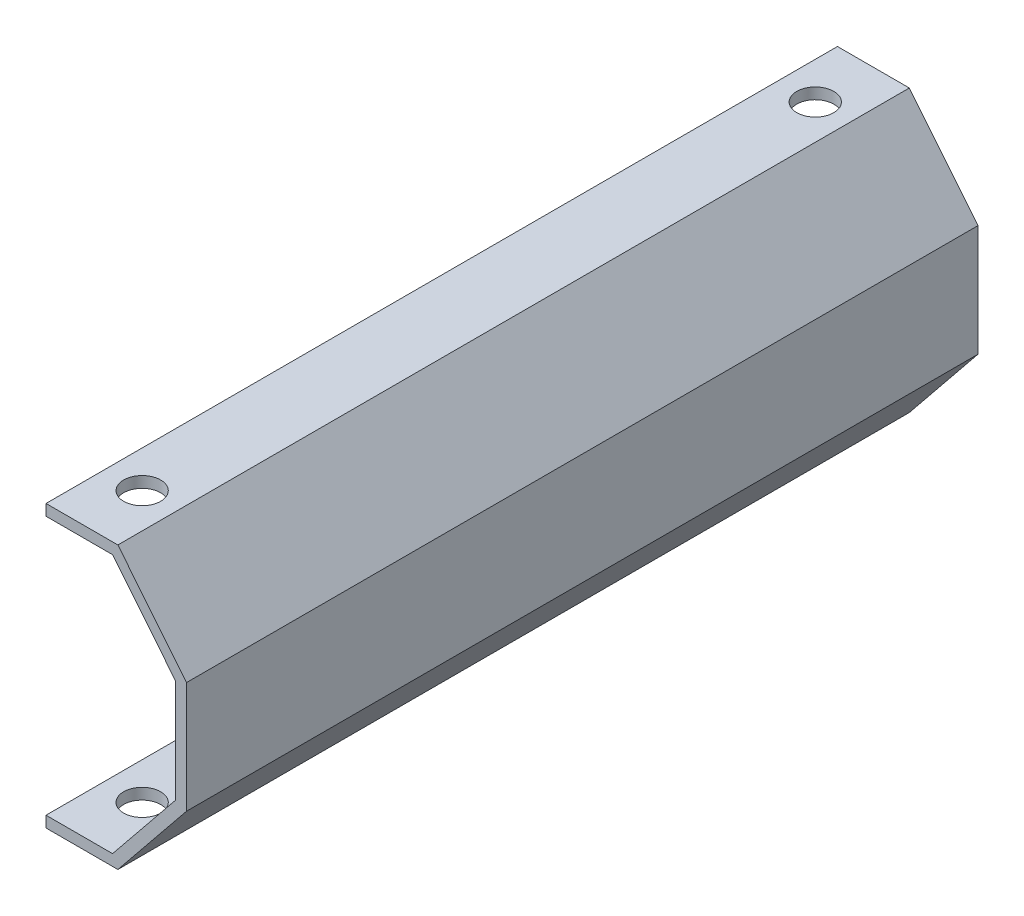
ISO-10303-21;
HEADER;
FILE_DESCRIPTION(('STEP AP214'),'2;1');
FILE_NAME('part.step','',(''),(''),'','','');
FILE_SCHEMA(('AUTOMOTIVE_DESIGN { 1 0 10303 214 1 1 1 1 }'));
ENDSEC;
DATA;
#1=APPLICATION_CONTEXT('core data for automotive mechanical design processes');
#2=APPLICATION_PROTOCOL_DEFINITION('international standard','automotive_design',2000,#1);
#3=PRODUCT_CONTEXT('',#1,'mechanical');
#4=PRODUCT('Part','Part','',(#3));
#5=PRODUCT_RELATED_PRODUCT_CATEGORY('part','',(#4));
#6=PRODUCT_DEFINITION_FORMATION('','',#4);
#7=PRODUCT_DEFINITION_CONTEXT('part definition',#1,'design');
#8=PRODUCT_DEFINITION('design','',#6,#7);
#9=PRODUCT_DEFINITION_SHAPE('','',#8);
#10=(LENGTH_UNIT() NAMED_UNIT(*) SI_UNIT(.MILLI.,.METRE.));
#11=(NAMED_UNIT(*) PLANE_ANGLE_UNIT() SI_UNIT($,.RADIAN.));
#12=(NAMED_UNIT(*) SI_UNIT($,.STERADIAN.) SOLID_ANGLE_UNIT());
#13=UNCERTAINTY_MEASURE_WITH_UNIT(LENGTH_MEASURE(1.E-05),#10,'distance_accuracy_value','');
#14=(GEOMETRIC_REPRESENTATION_CONTEXT(3) GLOBAL_UNCERTAINTY_ASSIGNED_CONTEXT((#13)) GLOBAL_UNIT_ASSIGNED_CONTEXT((#10,
#11,#12)) REPRESENTATION_CONTEXT('',''));
#15=CARTESIAN_POINT('',(0.,0.,0.));
#16=DIRECTION('',(0.,0.,1.));
#17=DIRECTION('',(1.,0.,0.));
#18=AXIS2_PLACEMENT_3D('',#15,#16,#17);
#19=CARTESIAN_POINT('',(0.,0.,107.));
#20=DIRECTION('',(1.,0.,0.));
#21=DIRECTION('',(0.,0.,-1.));
#22=AXIS2_PLACEMENT_3D('',#19,#20,#21);
#23=PLANE('',#22);
#24=DIRECTION('',(0.,-1.,0.));
#25=VECTOR('',#24,1.);
#26=CARTESIAN_POINT('',(0.,0.,0.));
#27=LINE('',#26,#25);
#28=CARTESIAN_POINT('',(0.,0.,0.));
#29=VERTEX_POINT('',#28);
#30=CARTESIAN_POINT('',(0.,-1.5,0.));
#31=VERTEX_POINT('',#30);
#32=EDGE_CURVE('E153',#29,#31,#27,.T.);
#33=ORIENTED_EDGE('',*,*,#32,.T.);
#34=DIRECTION('',(0.,0.,-1.));
#35=VECTOR('',#34,1.);
#36=CARTESIAN_POINT('',(0.,-1.5,107.));
#37=LINE('',#36,#35);
#38=CARTESIAN_POINT('',(0.,-1.5,107.));
#39=VERTEX_POINT('',#38);
#40=EDGE_CURVE('E11',#39,#31,#37,.T.);
#41=ORIENTED_EDGE('',*,*,#40,.F.);
#42=DIRECTION('',(0.,-1.,0.));
#43=VECTOR('',#42,1.);
#44=CARTESIAN_POINT('',(0.,0.,107.));
#45=LINE('',#44,#43);
#46=CARTESIAN_POINT('',(0.,0.,107.));
#47=VERTEX_POINT('',#46);
#48=EDGE_CURVE('E176',#47,#39,#45,.T.);
#49=ORIENTED_EDGE('',*,*,#48,.F.);
#50=DIRECTION('',(0.,0.,-1.));
#51=VECTOR('',#50,1.);
#52=CARTESIAN_POINT('',(0.,0.,107.));
#53=LINE('',#52,#51);
#54=EDGE_CURVE('E149',#47,#29,#53,.T.);
#55=ORIENTED_EDGE('',*,*,#54,.T.);
#56=EDGE_LOOP('',(#33,#41,#49,#55));
#57=FACE_BOUND('',#56,.T.);
#58=ADVANCED_FACE('F33',(#57),#23,.F.);
#59=CARTESIAN_POINT('',(0.,-1.5,107.));
#60=DIRECTION('',(0.,1.,0.));
#61=DIRECTION('',(0.,0.,1.));
#62=AXIS2_PLACEMENT_3D('',#59,#60,#61);
#63=PLANE('',#62);
#64=CARTESIAN_POINT('',(4.99999999999999,-1.5,99.));
#65=DIRECTION('',(0.,-1.,0.));
#66=DIRECTION('',(0.,0.,1.));
#67=AXIS2_PLACEMENT_3D('',#64,#65,#66);
#68=CIRCLE('',#67,2.5);
#69=CARTESIAN_POINT('',(4.99999999999999,-1.5,101.5));
#70=VERTEX_POINT('',#69);
#71=EDGE_CURVE('E379',#70,#70,#68,.T.);
#72=ORIENTED_EDGE('',*,*,#71,.F.);
#73=EDGE_LOOP('',(#72));
#74=FACE_BOUND('',#73,.T.);
#75=CARTESIAN_POINT('',(5.,-1.5,7.99999999999999));
#76=DIRECTION('',(0.,-1.,0.));
#77=DIRECTION('',(0.,0.,-1.));
#78=AXIS2_PLACEMENT_3D('',#75,#76,#77);
#79=CIRCLE('',#78,2.5);
#80=CARTESIAN_POINT('',(5.,-1.5,5.49999999999999));
#81=VERTEX_POINT('',#80);
#82=EDGE_CURVE('E382',#81,#81,#79,.T.);
#83=ORIENTED_EDGE('',*,*,#82,.F.);
#84=EDGE_LOOP('',(#83));
#85=FACE_BOUND('',#84,.T.);
#86=DIRECTION('',(1.,0.,0.));
#87=VECTOR('',#86,1.);
#88=CARTESIAN_POINT('',(0.,-1.5,0.));
#89=LINE('',#88,#87);
#90=CARTESIAN_POINT('',(9.7156080123009,-1.5,0.));
#91=VERTEX_POINT('',#90);
#92=EDGE_CURVE('E156',#31,#91,#89,.T.);
#93=ORIENTED_EDGE('',*,*,#92,.T.);
#94=DIRECTION('',(0.,0.,-1.));
#95=VECTOR('',#94,1.);
#96=CARTESIAN_POINT('',(9.7156080123009,-1.5,107.));
#97=LINE('',#96,#95);
#98=CARTESIAN_POINT('',(9.7156080123009,-1.5,107.));
#99=VERTEX_POINT('',#98);
#100=EDGE_CURVE('E41',#99,#91,#97,.T.);
#101=ORIENTED_EDGE('',*,*,#100,.F.);
#102=DIRECTION('',(1.,0.,0.));
#103=VECTOR('',#102,1.);
#104=CARTESIAN_POINT('',(0.,-1.5,107.));
#105=LINE('',#104,#103);
#106=EDGE_CURVE('E104',#39,#99,#105,.T.);
#107=ORIENTED_EDGE('',*,*,#106,.F.);
#108=ORIENTED_EDGE('',*,*,#40,.T.);
#109=EDGE_LOOP('',(#93,#101,#107,#108));
#110=FACE_BOUND('',#109,.T.);
#111=ADVANCED_FACE('F257',(#74,#85,#110),#63,.F.);
#112=CARTESIAN_POINT('',(9.7156080123009,-1.5,107.));
#113=DIRECTION('',(-0.777244870707486,0.629198228667964,0.));
#114=DIRECTION('',(-0.629198228667964,-0.777244870707486,0.));
#115=AXIS2_PLACEMENT_3D('',#112,#113,#114);
#116=PLANE('',#115);
#117=DIRECTION('',(0.629198228667964,0.777244870707486,0.));
#118=VECTOR('',#117,1.);
#119=CARTESIAN_POINT('',(9.7156080123009,-1.5,0.));
#120=LINE('',#119,#118);
#121=CARTESIAN_POINT('',(19.,9.96895480833419,0.));
#122=VERTEX_POINT('',#121);
#123=EDGE_CURVE('E159',#91,#122,#120,.T.);
#124=ORIENTED_EDGE('',*,*,#123,.T.);
#125=DIRECTION('',(0.,0.,-1.));
#126=VECTOR('',#125,1.);
#127=CARTESIAN_POINT('',(19.,9.96895480833419,107.));
#128=LINE('',#127,#126);
#129=CARTESIAN_POINT('',(19.,9.96895480833419,107.));
#130=VERTEX_POINT('',#129);
#131=EDGE_CURVE('E195',#130,#122,#128,.T.);
#132=ORIENTED_EDGE('',*,*,#131,.F.);
#133=DIRECTION('',(0.629198228667964,0.777244870707486,0.));
#134=VECTOR('',#133,1.);
#135=CARTESIAN_POINT('',(9.7156080123009,-1.5,107.));
#136=LINE('',#135,#134);
#137=EDGE_CURVE('E203',#99,#130,#136,.T.);
#138=ORIENTED_EDGE('',*,*,#137,.F.);
#139=ORIENTED_EDGE('',*,*,#100,.T.);
#140=EDGE_LOOP('',(#124,#132,#138,#139));
#141=FACE_BOUND('',#140,.T.);
#142=ADVANCED_FACE('F201',(#141),#116,.F.);
#143=CARTESIAN_POINT('',(19.,9.96895480833419,107.));
#144=DIRECTION('',(-1.,0.,0.));
#145=DIRECTION('',(0.,0.,1.));
#146=AXIS2_PLACEMENT_3D('',#143,#144,#145);
#147=PLANE('',#146);
#148=DIRECTION('',(0.,1.,0.));
#149=VECTOR('',#148,1.);
#150=CARTESIAN_POINT('',(19.,9.96895480833419,0.));
#151=LINE('',#150,#149);
#152=CARTESIAN_POINT('',(19.,25.0310451916658,0.));
#153=VERTEX_POINT('',#152);
#154=EDGE_CURVE('E161',#122,#153,#151,.T.);
#155=ORIENTED_EDGE('',*,*,#154,.T.);
#156=DIRECTION('',(0.,0.,-1.));
#157=VECTOR('',#156,1.);
#158=CARTESIAN_POINT('',(19.,25.0310451916658,107.));
#159=LINE('',#158,#157);
#160=CARTESIAN_POINT('',(19.,25.0310451916658,107.));
#161=VERTEX_POINT('',#160);
#162=EDGE_CURVE('E192',#161,#153,#159,.T.);
#163=ORIENTED_EDGE('',*,*,#162,.F.);
#164=DIRECTION('',(0.,1.,0.));
#165=VECTOR('',#164,1.);
#166=CARTESIAN_POINT('',(19.,9.96895480833419,107.));
#167=LINE('',#166,#165);
#168=EDGE_CURVE('E221',#130,#161,#167,.T.);
#169=ORIENTED_EDGE('',*,*,#168,.F.);
#170=ORIENTED_EDGE('',*,*,#131,.T.);
#171=EDGE_LOOP('',(#155,#163,#169,#170));
#172=FACE_BOUND('',#171,.T.);
#173=ADVANCED_FACE('F212',(#172),#147,.F.);
#174=CARTESIAN_POINT('',(9.7156080123009,36.5,107.));
#175=DIRECTION('',(-0.777244870707485,-0.629198228667965,0.));
#176=DIRECTION('',(0.629198228667965,-0.777244870707485,0.));
#177=AXIS2_PLACEMENT_3D('',#174,#175,#176);
#178=PLANE('',#177);
#179=DIRECTION('',(-0.629198228667965,0.777244870707485,0.));
#180=VECTOR('',#179,1.);
#181=CARTESIAN_POINT('',(9.7156080123009,36.5,0.));
#182=LINE('',#181,#180);
#183=CARTESIAN_POINT('',(9.7156080123009,36.5,0.));
#184=VERTEX_POINT('',#183);
#185=EDGE_CURVE('E163',#153,#184,#182,.T.);
#186=ORIENTED_EDGE('',*,*,#185,.T.);
#187=DIRECTION('',(0.,0.,-1.));
#188=VECTOR('',#187,1.);
#189=CARTESIAN_POINT('',(9.7156080123009,36.5,107.));
#190=LINE('',#189,#188);
#191=CARTESIAN_POINT('',(9.7156080123009,36.5,107.));
#192=VERTEX_POINT('',#191);
#193=EDGE_CURVE('E189',#192,#184,#190,.T.);
#194=ORIENTED_EDGE('',*,*,#193,.F.);
#195=DIRECTION('',(-0.629198228667965,0.777244870707485,0.));
#196=VECTOR('',#195,1.);
#197=CARTESIAN_POINT('',(9.7156080123009,36.5,107.));
#198=LINE('',#197,#196);
#199=EDGE_CURVE('E218',#161,#192,#198,.T.);
#200=ORIENTED_EDGE('',*,*,#199,.F.);
#201=ORIENTED_EDGE('',*,*,#162,.T.);
#202=EDGE_LOOP('',(#186,#194,#200,#201));
#203=FACE_BOUND('',#202,.T.);
#204=ADVANCED_FACE('F216',(#203),#178,.F.);
#205=CARTESIAN_POINT('',(0.,36.5,107.));
#206=DIRECTION('',(0.,-1.,0.));
#207=DIRECTION('',(0.,0.,-1.));
#208=AXIS2_PLACEMENT_3D('',#205,#206,#207);
#209=PLANE('',#208);
#210=CARTESIAN_POINT('',(5.00000000000001,36.5,99.));
#211=DIRECTION('',(0.,1.,0.));
#212=DIRECTION('',(0.,0.,-1.));
#213=AXIS2_PLACEMENT_3D('',#210,#211,#212);
#214=CIRCLE('',#213,2.5);
#215=CARTESIAN_POINT('',(5.00000000000001,36.5,96.5));
#216=VERTEX_POINT('',#215);
#217=EDGE_CURVE('E391',#216,#216,#214,.T.);
#218=ORIENTED_EDGE('',*,*,#217,.F.);
#219=EDGE_LOOP('',(#218));
#220=FACE_BOUND('',#219,.T.);
#221=CARTESIAN_POINT('',(5.,36.5,7.99999999999999));
#222=DIRECTION('',(0.,1.,0.));
#223=DIRECTION('',(0.,0.,1.));
#224=AXIS2_PLACEMENT_3D('',#221,#222,#223);
#225=CIRCLE('',#224,2.5);
#226=CARTESIAN_POINT('',(5.,36.5,10.5));
#227=VERTEX_POINT('',#226);
#228=EDGE_CURVE('E397',#227,#227,#225,.T.);
#229=ORIENTED_EDGE('',*,*,#228,.F.);
#230=EDGE_LOOP('',(#229));
#231=FACE_BOUND('',#230,.T.);
#232=DIRECTION('',(-1.,0.,0.));
#233=VECTOR('',#232,1.);
#234=CARTESIAN_POINT('',(0.,36.5,0.));
#235=LINE('',#234,#233);
#236=CARTESIAN_POINT('',(0.,36.5,0.));
#237=VERTEX_POINT('',#236);
#238=EDGE_CURVE('E165',#184,#237,#235,.T.);
#239=ORIENTED_EDGE('',*,*,#238,.T.);
#240=DIRECTION('',(0.,0.,-1.));
#241=VECTOR('',#240,1.);
#242=CARTESIAN_POINT('',(0.,36.5,107.));
#243=LINE('',#242,#241);
#244=CARTESIAN_POINT('',(0.,36.5,107.));
#245=VERTEX_POINT('',#244);
#246=EDGE_CURVE('E186',#245,#237,#243,.T.);
#247=ORIENTED_EDGE('',*,*,#246,.F.);
#248=DIRECTION('',(-1.,0.,0.));
#249=VECTOR('',#248,1.);
#250=CARTESIAN_POINT('',(0.,36.5,107.));
#251=LINE('',#250,#249);
#252=EDGE_CURVE('E220',#192,#245,#251,.T.);
#253=ORIENTED_EDGE('',*,*,#252,.F.);
#254=ORIENTED_EDGE('',*,*,#193,.T.);
#255=EDGE_LOOP('',(#239,#247,#253,#254));
#256=FACE_BOUND('',#255,.T.);
#257=ADVANCED_FACE('F273',(#220,#231,#256),#209,.F.);
#258=CARTESIAN_POINT('',(0.,36.5,107.));
#259=DIRECTION('',(1.,0.,0.));
#260=DIRECTION('',(0.,1.,0.));
#261=AXIS2_PLACEMENT_3D('',#258,#259,#260);
#262=PLANE('',#261);
#263=DIRECTION('',(0.,-1.,0.));
#264=VECTOR('',#263,1.);
#265=CARTESIAN_POINT('',(0.,36.5,0.));
#266=LINE('',#265,#264);
#267=CARTESIAN_POINT('',(0.,35.,0.));
#268=VERTEX_POINT('',#267);
#269=EDGE_CURVE('E167',#237,#268,#266,.T.);
#270=ORIENTED_EDGE('',*,*,#269,.T.);
#271=DIRECTION('',(0.,0.,-1.));
#272=VECTOR('',#271,1.);
#273=CARTESIAN_POINT('',(0.,35.,107.));
#274=LINE('',#273,#272);
#275=CARTESIAN_POINT('',(0.,35.,107.));
#276=VERTEX_POINT('',#275);
#277=EDGE_CURVE('E183',#276,#268,#274,.T.);
#278=ORIENTED_EDGE('',*,*,#277,.F.);
#279=DIRECTION('',(0.,-1.,0.));
#280=VECTOR('',#279,1.);
#281=CARTESIAN_POINT('',(0.,36.5,107.));
#282=LINE('',#281,#280);
#283=EDGE_CURVE('E223',#245,#276,#282,.T.);
#284=ORIENTED_EDGE('',*,*,#283,.F.);
#285=ORIENTED_EDGE('',*,*,#246,.T.);
#286=EDGE_LOOP('',(#270,#278,#284,#285));
#287=FACE_BOUND('',#286,.T.);
#288=ADVANCED_FACE('F276',(#287),#262,.F.);
#289=CARTESIAN_POINT('',(0.,35.,107.));
#290=DIRECTION('',(0.,1.,0.));
#291=DIRECTION('',(-1.,0.,0.));
#292=AXIS2_PLACEMENT_3D('',#289,#290,#291);
#293=PLANE('',#292);
#294=CARTESIAN_POINT('',(5.00000000000001,35.,99.));
#295=DIRECTION('',(0.,1.,0.));
#296=DIRECTION('',(-1.,0.,0.));
#297=AXIS2_PLACEMENT_3D('',#294,#295,#296);
#298=CIRCLE('',#297,2.5);
#299=CARTESIAN_POINT('',(2.50000000000001,35.,99.));
#300=VERTEX_POINT('',#299);
#301=EDGE_CURVE('E394',#300,#300,#298,.F.);
#302=ORIENTED_EDGE('',*,*,#301,.F.);
#303=EDGE_LOOP('',(#302));
#304=FACE_BOUND('',#303,.T.);
#305=CARTESIAN_POINT('',(5.,35.,7.99999999999999));
#306=DIRECTION('',(0.,1.,0.));
#307=DIRECTION('',(-1.,0.,0.));
#308=AXIS2_PLACEMENT_3D('',#305,#306,#307);
#309=CIRCLE('',#308,2.5);
#310=CARTESIAN_POINT('',(2.5,35.,7.99999999999999));
#311=VERTEX_POINT('',#310);
#312=EDGE_CURVE('E157',#311,#311,#309,.F.);
#313=ORIENTED_EDGE('',*,*,#312,.F.);
#314=EDGE_LOOP('',(#313));
#315=FACE_BOUND('',#314,.T.);
#316=DIRECTION('',(1.,0.,0.));
#317=VECTOR('',#316,1.);
#318=CARTESIAN_POINT('',(0.,35.,0.));
#319=LINE('',#318,#317);
#320=CARTESIAN_POINT('',(9.,35.,0.));
#321=VERTEX_POINT('',#320);
#322=EDGE_CURVE('E169',#268,#321,#319,.T.);
#323=ORIENTED_EDGE('',*,*,#322,.T.);
#324=DIRECTION('',(0.,0.,-1.));
#325=VECTOR('',#324,1.);
#326=CARTESIAN_POINT('',(9.,35.,107.));
#327=LINE('',#326,#325);
#328=CARTESIAN_POINT('',(9.,35.,107.));
#329=VERTEX_POINT('',#328);
#330=EDGE_CURVE('E180',#329,#321,#327,.T.);
#331=ORIENTED_EDGE('',*,*,#330,.F.);
#332=DIRECTION('',(1.,0.,0.));
#333=VECTOR('',#332,1.);
#334=CARTESIAN_POINT('',(0.,35.,107.));
#335=LINE('',#334,#333);
#336=EDGE_CURVE('E229',#276,#329,#335,.T.);
#337=ORIENTED_EDGE('',*,*,#336,.F.);
#338=ORIENTED_EDGE('',*,*,#277,.T.);
#339=EDGE_LOOP('',(#323,#331,#337,#338));
#340=FACE_BOUND('',#339,.T.);
#341=ADVANCED_FACE('F235',(#304,#315,#340),#293,.F.);
#342=CARTESIAN_POINT('',(9.,35.,107.));
#343=DIRECTION('',(0.777244870707486,0.629198228667965,0.));
#344=DIRECTION('',(-0.629198228667965,0.777244870707486,0.));
#345=AXIS2_PLACEMENT_3D('',#342,#343,#344);
#346=PLANE('',#345);
#347=DIRECTION('',(0.629198228667964,-0.777244870707485,0.));
#348=VECTOR('',#347,1.);
#349=CARTESIAN_POINT('',(9.,35.,0.));
#350=LINE('',#349,#348);
#351=CARTESIAN_POINT('',(17.5,24.5,0.));
#352=VERTEX_POINT('',#351);
#353=EDGE_CURVE('E171',#321,#352,#350,.T.);
#354=ORIENTED_EDGE('',*,*,#353,.T.);
#355=DIRECTION('',(0.,0.,-1.));
#356=VECTOR('',#355,1.);
#357=CARTESIAN_POINT('',(17.5,24.5,107.));
#358=LINE('',#357,#356);
#359=CARTESIAN_POINT('',(17.5,24.5,107.));
#360=VERTEX_POINT('',#359);
#361=EDGE_CURVE('E144',#360,#352,#358,.T.);
#362=ORIENTED_EDGE('',*,*,#361,.F.);
#363=DIRECTION('',(0.629198228667964,-0.777244870707485,0.));
#364=VECTOR('',#363,1.);
#365=CARTESIAN_POINT('',(9.,35.,107.));
#366=LINE('',#365,#364);
#367=EDGE_CURVE('E135',#329,#360,#366,.T.);
#368=ORIENTED_EDGE('',*,*,#367,.F.);
#369=ORIENTED_EDGE('',*,*,#330,.T.);
#370=EDGE_LOOP('',(#354,#362,#368,#369));
#371=FACE_BOUND('',#370,.T.);
#372=ADVANCED_FACE('F239',(#371),#346,.F.);
#373=CARTESIAN_POINT('',(17.5,10.5,107.));
#374=DIRECTION('',(1.,0.,0.));
#375=DIRECTION('',(0.,0.,-1.));
#376=AXIS2_PLACEMENT_3D('',#373,#374,#375);
#377=PLANE('',#376);
#378=DIRECTION('',(0.,-1.,0.));
#379=VECTOR('',#378,1.);
#380=CARTESIAN_POINT('',(17.5,10.5,0.));
#381=LINE('',#380,#379);
#382=CARTESIAN_POINT('',(17.5,10.5,0.));
#383=VERTEX_POINT('',#382);
#384=EDGE_CURVE('E143',#352,#383,#381,.T.);
#385=ORIENTED_EDGE('',*,*,#384,.T.);
#386=DIRECTION('',(0.,0.,-1.));
#387=VECTOR('',#386,1.);
#388=CARTESIAN_POINT('',(17.5,10.5,107.));
#389=LINE('',#388,#387);
#390=CARTESIAN_POINT('',(17.5,10.5,107.));
#391=VERTEX_POINT('',#390);
#392=EDGE_CURVE('E140',#391,#383,#389,.T.);
#393=ORIENTED_EDGE('',*,*,#392,.F.);
#394=DIRECTION('',(0.,-1.,0.));
#395=VECTOR('',#394,1.);
#396=CARTESIAN_POINT('',(17.5,10.5,107.));
#397=LINE('',#396,#395);
#398=EDGE_CURVE('E129',#360,#391,#397,.T.);
#399=ORIENTED_EDGE('',*,*,#398,.F.);
#400=ORIENTED_EDGE('',*,*,#361,.T.);
#401=EDGE_LOOP('',(#385,#393,#399,#400));
#402=FACE_BOUND('',#401,.T.);
#403=ADVANCED_FACE('F141',(#402),#377,.F.);
#404=CARTESIAN_POINT('',(9.,0.,107.));
#405=DIRECTION('',(0.777244870707486,-0.629198228667964,0.));
#406=DIRECTION('',(0.629198228667964,0.777244870707486,0.));
#407=AXIS2_PLACEMENT_3D('',#404,#405,#406);
#408=PLANE('',#407);
#409=DIRECTION('',(-0.629198228667964,-0.777244870707486,0.));
#410=VECTOR('',#409,1.);
#411=CARTESIAN_POINT('',(9.,0.,0.));
#412=LINE('',#411,#410);
#413=CARTESIAN_POINT('',(9.,0.,0.));
#414=VERTEX_POINT('',#413);
#415=EDGE_CURVE('E90',#383,#414,#412,.T.);
#416=ORIENTED_EDGE('',*,*,#415,.T.);
#417=DIRECTION('',(0.,0.,-1.));
#418=VECTOR('',#417,1.);
#419=CARTESIAN_POINT('',(9.,0.,107.));
#420=LINE('',#419,#418);
#421=CARTESIAN_POINT('',(9.,0.,107.));
#422=VERTEX_POINT('',#421);
#423=EDGE_CURVE('E145',#422,#414,#420,.T.);
#424=ORIENTED_EDGE('',*,*,#423,.F.);
#425=DIRECTION('',(-0.629198228667964,-0.777244870707486,0.));
#426=VECTOR('',#425,1.);
#427=CARTESIAN_POINT('',(9.,0.,107.));
#428=LINE('',#427,#426);
#429=EDGE_CURVE('E133',#391,#422,#428,.T.);
#430=ORIENTED_EDGE('',*,*,#429,.F.);
#431=ORIENTED_EDGE('',*,*,#392,.T.);
#432=EDGE_LOOP('',(#416,#424,#430,#431));
#433=FACE_BOUND('',#432,.T.);
#434=ADVANCED_FACE('F147',(#433),#408,.F.);
#435=CARTESIAN_POINT('',(0.,0.,107.));
#436=DIRECTION('',(0.,-1.,0.));
#437=DIRECTION('',(0.,0.,-1.));
#438=AXIS2_PLACEMENT_3D('',#435,#436,#437);
#439=PLANE('',#438);
#440=CARTESIAN_POINT('',(4.99999999999999,0.,99.));
#441=DIRECTION('',(0.,-1.,0.));
#442=DIRECTION('',(0.,0.,-1.));
#443=AXIS2_PLACEMENT_3D('',#440,#441,#442);
#444=CIRCLE('',#443,2.5);
#445=CARTESIAN_POINT('',(4.99999999999999,0.,96.5));
#446=VERTEX_POINT('',#445);
#447=EDGE_CURVE('E381',#446,#446,#444,.F.);
#448=ORIENTED_EDGE('',*,*,#447,.F.);
#449=EDGE_LOOP('',(#448));
#450=FACE_BOUND('',#449,.T.);
#451=CARTESIAN_POINT('',(5.,0.,7.99999999999999));
#452=DIRECTION('',(0.,-1.,0.));
#453=DIRECTION('',(0.,0.,-1.));
#454=AXIS2_PLACEMENT_3D('',#451,#452,#453);
#455=CIRCLE('',#454,2.5);
#456=CARTESIAN_POINT('',(5.,0.,5.49999999999999));
#457=VERTEX_POINT('',#456);
#458=EDGE_CURVE('E385',#457,#457,#455,.F.);
#459=ORIENTED_EDGE('',*,*,#458,.F.);
#460=EDGE_LOOP('',(#459));
#461=FACE_BOUND('',#460,.T.);
#462=DIRECTION('',(-1.,0.,0.));
#463=VECTOR('',#462,1.);
#464=CARTESIAN_POINT('',(0.,0.,0.));
#465=LINE('',#464,#463);
#466=EDGE_CURVE('E96',#414,#29,#465,.T.);
#467=ORIENTED_EDGE('',*,*,#466,.T.);
#468=ORIENTED_EDGE('',*,*,#54,.F.);
#469=DIRECTION('',(-1.,0.,0.));
#470=VECTOR('',#469,1.);
#471=CARTESIAN_POINT('',(0.,0.,107.));
#472=LINE('',#471,#470);
#473=EDGE_CURVE('E49',#422,#47,#472,.T.);
#474=ORIENTED_EDGE('',*,*,#473,.F.);
#475=ORIENTED_EDGE('',*,*,#423,.T.);
#476=EDGE_LOOP('',(#467,#468,#474,#475));
#477=FACE_BOUND('',#476,.T.);
#478=ADVANCED_FACE('F243',(#450,#461,#477),#439,.F.);
#479=CARTESIAN_POINT('',(0.,0.,107.));
#480=DIRECTION('',(0.,0.,1.));
#481=DIRECTION('',(1.,0.,0.));
#482=AXIS2_PLACEMENT_3D('',#479,#480,#481);
#483=PLANE('',#482);
#484=ORIENTED_EDGE('',*,*,#48,.T.);
#485=ORIENTED_EDGE('',*,*,#106,.T.);
#486=ORIENTED_EDGE('',*,*,#137,.T.);
#487=ORIENTED_EDGE('',*,*,#168,.T.);
#488=ORIENTED_EDGE('',*,*,#199,.T.);
#489=ORIENTED_EDGE('',*,*,#252,.T.);
#490=ORIENTED_EDGE('',*,*,#283,.T.);
#491=ORIENTED_EDGE('',*,*,#336,.T.);
#492=ORIENTED_EDGE('',*,*,#367,.T.);
#493=ORIENTED_EDGE('',*,*,#398,.T.);
#494=ORIENTED_EDGE('',*,*,#429,.T.);
#495=ORIENTED_EDGE('',*,*,#473,.T.);
#496=EDGE_LOOP('',(#484,#485,#486,#487,#488,#489,#490,#491,#492,#493,#494,#495));
#497=FACE_BOUND('',#496,.T.);
#498=ADVANCED_FACE('F131',(#497),#483,.T.);
#499=CARTESIAN_POINT('',(0.,0.,0.));
#500=DIRECTION('',(0.,0.,1.));
#501=DIRECTION('',(1.,0.,0.));
#502=AXIS2_PLACEMENT_3D('',#499,#500,#501);
#503=PLANE('',#502);
#504=ORIENTED_EDGE('',*,*,#32,.F.);
#505=ORIENTED_EDGE('',*,*,#466,.F.);
#506=ORIENTED_EDGE('',*,*,#415,.F.);
#507=ORIENTED_EDGE('',*,*,#384,.F.);
#508=ORIENTED_EDGE('',*,*,#353,.F.);
#509=ORIENTED_EDGE('',*,*,#322,.F.);
#510=ORIENTED_EDGE('',*,*,#269,.F.);
#511=ORIENTED_EDGE('',*,*,#238,.F.);
#512=ORIENTED_EDGE('',*,*,#185,.F.);
#513=ORIENTED_EDGE('',*,*,#154,.F.);
#514=ORIENTED_EDGE('',*,*,#123,.F.);
#515=ORIENTED_EDGE('',*,*,#92,.F.);
#516=EDGE_LOOP('',(#504,#505,#506,#507,#508,#509,#510,#511,#512,#513,#514,#515));
#517=FACE_BOUND('',#516,.T.);
#518=ADVANCED_FACE('F207',(#517),#503,.F.);
#519=CARTESIAN_POINT('',(5.,-1.501,7.99999999999999));
#520=DIRECTION('',(0.,1.,0.));
#521=DIRECTION('',(0.,0.,1.));
#522=AXIS2_PLACEMENT_3D('',#519,#520,#521);
#523=CYLINDRICAL_SURFACE('',#522,2.5);
#524=ORIENTED_EDGE('',*,*,#228,.T.);
#525=EDGE_LOOP('',(#524));
#526=FACE_BOUND('',#525,.T.);
#527=ORIENTED_EDGE('',*,*,#312,.T.);
#528=EDGE_LOOP('',(#527));
#529=FACE_BOUND('',#528,.T.);
#530=ADVANCED_FACE('F311',(#526,#529),#523,.F.);
#531=CARTESIAN_POINT('',(5.00000000000001,-1.501,99.));
#532=DIRECTION('',(0.,1.,0.));
#533=DIRECTION('',(0.,0.,1.));
#534=AXIS2_PLACEMENT_3D('',#531,#532,#533);
#535=CYLINDRICAL_SURFACE('',#534,2.5);
#536=ORIENTED_EDGE('',*,*,#217,.T.);
#537=EDGE_LOOP('',(#536));
#538=FACE_BOUND('',#537,.T.);
#539=ORIENTED_EDGE('',*,*,#301,.T.);
#540=EDGE_LOOP('',(#539));
#541=FACE_BOUND('',#540,.T.);
#542=ADVANCED_FACE('F334',(#538,#541),#535,.F.);
#543=CARTESIAN_POINT('',(5.,36.501,7.99999999999999));
#544=DIRECTION('',(0.,-1.,0.));
#545=DIRECTION('',(0.,0.,-1.));
#546=AXIS2_PLACEMENT_3D('',#543,#544,#545);
#547=CYLINDRICAL_SURFACE('',#546,2.5);
#548=ORIENTED_EDGE('',*,*,#82,.T.);
#549=EDGE_LOOP('',(#548));
#550=FACE_BOUND('',#549,.T.);
#551=ORIENTED_EDGE('',*,*,#458,.T.);
#552=EDGE_LOOP('',(#551));
#553=FACE_BOUND('',#552,.T.);
#554=ADVANCED_FACE('F343',(#550,#553),#547,.F.);
#555=CARTESIAN_POINT('',(4.99999999999999,36.501,99.));
#556=DIRECTION('',(0.,-1.,0.));
#557=DIRECTION('',(0.,0.,-1.));
#558=AXIS2_PLACEMENT_3D('',#555,#556,#557);
#559=CYLINDRICAL_SURFACE('',#558,2.5);
#560=ORIENTED_EDGE('',*,*,#71,.T.);
#561=EDGE_LOOP('',(#560));
#562=FACE_BOUND('',#561,.T.);
#563=ORIENTED_EDGE('',*,*,#447,.T.);
#564=EDGE_LOOP('',(#563));
#565=FACE_BOUND('',#564,.T.);
#566=ADVANCED_FACE('F363',(#562,#565),#559,.F.);
#567=CLOSED_SHELL('',(#58,#111,#142,#173,#204,#257,#288,#341,#372,#403,#434,#478,#498,#518,#530,
#542,#554,#566));
#568=MANIFOLD_SOLID_BREP('B2',#567);
#569=ADVANCED_BREP_SHAPE_REPRESENTATION('',(#18,#568),#14);
#570=SHAPE_DEFINITION_REPRESENTATION(#9,#569);
ENDSEC;
END-ISO-10303-21;
